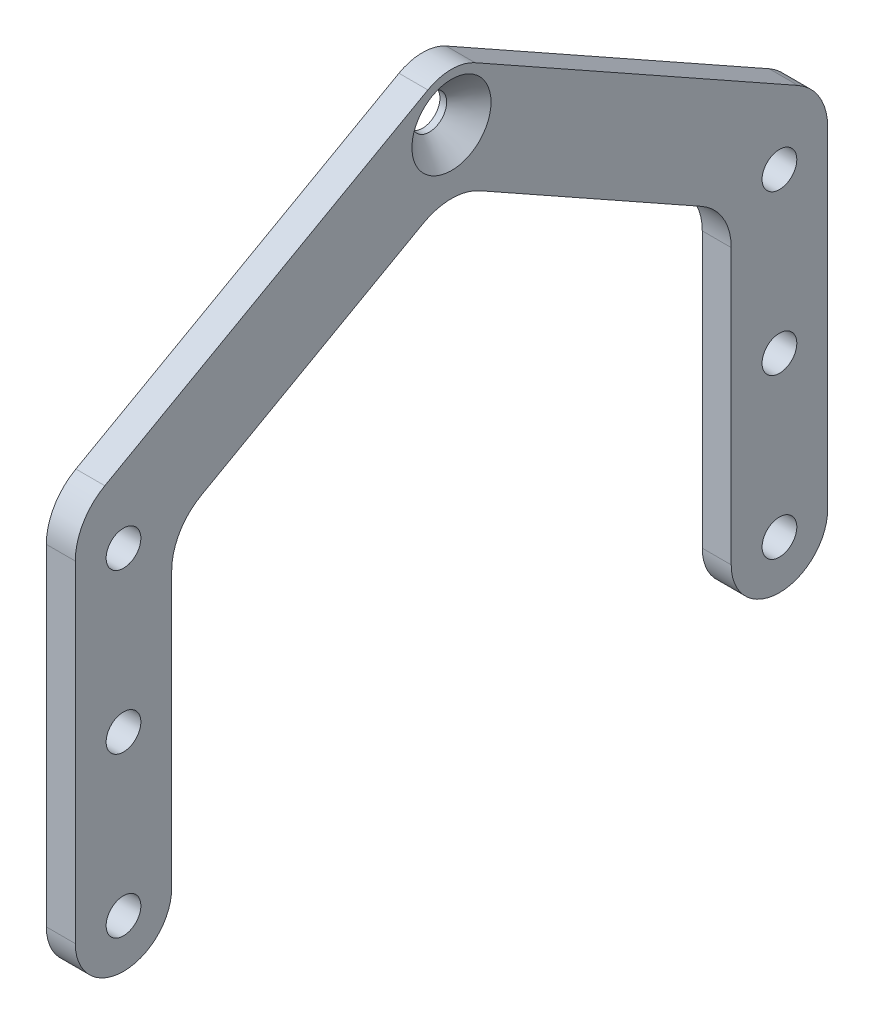
ISO-10303-21;
HEADER;
FILE_DESCRIPTION(('STEP AP214'),'2;1');
FILE_NAME('part.step','',(''),(''),'','','');
FILE_SCHEMA(('AUTOMOTIVE_DESIGN { 1 0 10303 214 1 1 1 1 }'));
ENDSEC;
DATA;
#1=APPLICATION_CONTEXT('core data for automotive mechanical design processes');
#2=APPLICATION_PROTOCOL_DEFINITION('international standard','automotive_design',2000,#1);
#3=PRODUCT_CONTEXT('',#1,'mechanical');
#4=PRODUCT('Part','Part','',(#3));
#5=PRODUCT_RELATED_PRODUCT_CATEGORY('part','',(#4));
#6=PRODUCT_DEFINITION_FORMATION('','',#4);
#7=PRODUCT_DEFINITION_CONTEXT('part definition',#1,'design');
#8=PRODUCT_DEFINITION('design','',#6,#7);
#9=PRODUCT_DEFINITION_SHAPE('','',#8);
#10=(LENGTH_UNIT() NAMED_UNIT(*) SI_UNIT(.MILLI.,.METRE.));
#11=(NAMED_UNIT(*) PLANE_ANGLE_UNIT() SI_UNIT($,.RADIAN.));
#12=(NAMED_UNIT(*) SI_UNIT($,.STERADIAN.) SOLID_ANGLE_UNIT());
#13=UNCERTAINTY_MEASURE_WITH_UNIT(LENGTH_MEASURE(1.E-05),#10,'distance_accuracy_value','');
#14=(GEOMETRIC_REPRESENTATION_CONTEXT(3) GLOBAL_UNCERTAINTY_ASSIGNED_CONTEXT((#13)) GLOBAL_UNIT_ASSIGNED_CONTEXT((#10,
#11,#12)) REPRESENTATION_CONTEXT('',''));
#15=CARTESIAN_POINT('',(0.,0.,0.));
#16=DIRECTION('',(0.,0.,1.));
#17=DIRECTION('',(1.,0.,0.));
#18=AXIS2_PLACEMENT_3D('',#15,#16,#17);
#19=CARTESIAN_POINT('',(1.5,0.,17.));
#20=DIRECTION('',(1.,0.,0.));
#21=DIRECTION('',(0.,0.,-1.));
#22=AXIS2_PLACEMENT_3D('',#19,#20,#21);
#23=PLANE('',#22);
#24=CARTESIAN_POINT('',(1.5,27.,0.));
#25=DIRECTION('',(1.,0.,0.));
#26=DIRECTION('',(0.,0.,-1.));
#27=AXIS2_PLACEMENT_3D('',#24,#25,#26);
#28=CIRCLE('',#27,2.05);
#29=CARTESIAN_POINT('',(1.5,27.,-2.05));
#30=VERTEX_POINT('',#29);
#31=EDGE_CURVE('E246',#30,#30,#28,.T.);
#32=ORIENTED_EDGE('',*,*,#31,.F.);
#33=EDGE_LOOP('',(#32));
#34=FACE_BOUND('',#33,.T.);
#35=CARTESIAN_POINT('',(1.5,8.25000000000001,-17.));
#36=DIRECTION('',(1.,0.,0.));
#37=DIRECTION('',(0.,0.,1.));
#38=AXIS2_PLACEMENT_3D('',#35,#36,#37);
#39=CIRCLE('',#38,0.9);
#40=CARTESIAN_POINT('',(1.5,8.25000000000001,-16.1));
#41=VERTEX_POINT('',#40);
#42=EDGE_CURVE('E236',#41,#41,#39,.T.);
#43=ORIENTED_EDGE('',*,*,#42,.F.);
#44=EDGE_LOOP('',(#43));
#45=FACE_BOUND('',#44,.T.);
#46=CARTESIAN_POINT('',(1.5,8.25,17.));
#47=DIRECTION('',(1.,0.,0.));
#48=DIRECTION('',(0.,0.,-1.));
#49=AXIS2_PLACEMENT_3D('',#46,#47,#48);
#50=CIRCLE('',#49,0.9);
#51=CARTESIAN_POINT('',(1.5,8.25,16.1));
#52=VERTEX_POINT('',#51);
#53=EDGE_CURVE('E233',#52,#52,#50,.T.);
#54=ORIENTED_EDGE('',*,*,#53,.F.);
#55=EDGE_LOOP('',(#54));
#56=FACE_BOUND('',#55,.T.);
#57=CARTESIAN_POINT('',(1.5,16.5,-17.));
#58=DIRECTION('',(1.,0.,0.));
#59=DIRECTION('',(0.,0.,1.));
#60=AXIS2_PLACEMENT_3D('',#57,#58,#59);
#61=CIRCLE('',#60,0.900000000000001);
#62=CARTESIAN_POINT('',(1.5,16.5,-16.1));
#63=VERTEX_POINT('',#62);
#64=EDGE_CURVE('E230',#63,#63,#61,.T.);
#65=ORIENTED_EDGE('',*,*,#64,.F.);
#66=EDGE_LOOP('',(#65));
#67=FACE_BOUND('',#66,.T.);
#68=CARTESIAN_POINT('',(1.5,16.5,17.));
#69=DIRECTION('',(1.,0.,0.));
#70=DIRECTION('',(0.,0.,-1.));
#71=AXIS2_PLACEMENT_3D('',#68,#69,#70);
#72=CIRCLE('',#71,0.900000000000001);
#73=CARTESIAN_POINT('',(1.5,16.5,16.1));
#74=VERTEX_POINT('',#73);
#75=EDGE_CURVE('E226',#74,#74,#72,.T.);
#76=ORIENTED_EDGE('',*,*,#75,.F.);
#77=EDGE_LOOP('',(#76));
#78=FACE_BOUND('',#77,.T.);
#79=CARTESIAN_POINT('',(1.5,0.,-17.));
#80=DIRECTION('',(1.,0.,0.));
#81=DIRECTION('',(0.,0.,1.));
#82=AXIS2_PLACEMENT_3D('',#79,#80,#81);
#83=CIRCLE('',#82,0.9);
#84=CARTESIAN_POINT('',(1.5,0.,-16.1));
#85=VERTEX_POINT('',#84);
#86=EDGE_CURVE('E256',#85,#85,#83,.T.);
#87=ORIENTED_EDGE('',*,*,#86,.F.);
#88=EDGE_LOOP('',(#87));
#89=FACE_BOUND('',#88,.T.);
#90=DIRECTION('',(0.,1.,0.));
#91=VECTOR('',#90,1.);
#92=CARTESIAN_POINT('',(1.5,0.,-19.5));
#93=LINE('',#92,#91);
#94=CARTESIAN_POINT('',(1.5,0.,-19.5));
#95=VERTEX_POINT('',#94);
#96=CARTESIAN_POINT('',(1.5,17.1712927295533,-19.5));
#97=VERTEX_POINT('',#96);
#98=EDGE_CURVE('E276',#95,#97,#93,.T.);
#99=ORIENTED_EDGE('',*,*,#98,.T.);
#100=CARTESIAN_POINT('',(1.5,17.1712927295533,-16.5));
#101=DIRECTION('',(1.,0.,0.));
#102=DIRECTION('',(0.,0.,-1.));
#103=AXIS2_PLACEMENT_3D('',#100,#101,#102);
#104=CIRCLE('',#103,3.);
#105=CARTESIAN_POINT('',(1.5,19.7877679066504,-17.9676708240047));
#106=VERTEX_POINT('',#105);
#107=EDGE_CURVE('E193',#97,#106,#104,.T.);
#108=ORIENTED_EDGE('',*,*,#107,.T.);
#109=DIRECTION('',(0.,0.489223608001568,0.872158392365703));
#110=VECTOR('',#109,1.);
#111=CARTESIAN_POINT('',(1.5,29.1803959809143,-1.22305902000392));
#112=LINE('',#111,#110);
#113=CARTESIAN_POINT('',(1.5,29.1803959809143,-1.22305902000392));
#114=VERTEX_POINT('',#113);
#115=EDGE_CURVE('E278',#106,#114,#112,.T.);
#116=ORIENTED_EDGE('',*,*,#115,.T.);
#117=CARTESIAN_POINT('',(1.5,27.,0.));
#118=DIRECTION('',(1.,0.,0.));
#119=DIRECTION('',(0.,0.,-1.));
#120=AXIS2_PLACEMENT_3D('',#117,#118,#119);
#121=CIRCLE('',#120,2.5);
#122=CARTESIAN_POINT('',(1.5,29.1803959809143,1.22305902000392));
#123=VERTEX_POINT('',#122);
#124=EDGE_CURVE('E280',#114,#123,#121,.T.);
#125=ORIENTED_EDGE('',*,*,#124,.T.);
#126=DIRECTION('',(0.,-0.489223608001568,0.872158392365703));
#127=VECTOR('',#126,1.);
#128=CARTESIAN_POINT('',(1.5,18.9282318238833,19.5));
#129=LINE('',#128,#127);
#130=CARTESIAN_POINT('',(1.5,19.7877679066504,17.9676708240047));
#131=VERTEX_POINT('',#130);
#132=EDGE_CURVE('E282',#123,#131,#129,.T.);
#133=ORIENTED_EDGE('',*,*,#132,.T.);
#134=CARTESIAN_POINT('',(1.5,17.1712927295533,16.5));
#135=DIRECTION('',(1.,0.,0.));
#136=DIRECTION('',(0.,0.,-1.));
#137=AXIS2_PLACEMENT_3D('',#134,#135,#136);
#138=CIRCLE('',#137,3.);
#139=CARTESIAN_POINT('',(1.5,17.1712927295533,19.5));
#140=VERTEX_POINT('',#139);
#141=EDGE_CURVE('E52',#131,#140,#138,.T.);
#142=ORIENTED_EDGE('',*,*,#141,.T.);
#143=DIRECTION('',(0.,-1.,0.));
#144=VECTOR('',#143,1.);
#145=CARTESIAN_POINT('',(1.5,0.,19.5));
#146=LINE('',#145,#144);
#147=CARTESIAN_POINT('',(1.5,0.,19.5));
#148=VERTEX_POINT('',#147);
#149=EDGE_CURVE('E167',#140,#148,#146,.T.);
#150=ORIENTED_EDGE('',*,*,#149,.T.);
#151=CARTESIAN_POINT('',(1.5,0.,17.));
#152=DIRECTION('',(1.,0.,0.));
#153=DIRECTION('',(0.,0.,-1.));
#154=AXIS2_PLACEMENT_3D('',#151,#152,#153);
#155=CIRCLE('',#154,2.5);
#156=CARTESIAN_POINT('',(1.5,0.,14.5));
#157=VERTEX_POINT('',#156);
#158=EDGE_CURVE('E162',#148,#157,#155,.T.);
#159=ORIENTED_EDGE('',*,*,#158,.T.);
#160=DIRECTION('',(0.,1.,0.));
#161=VECTOR('',#160,1.);
#162=CARTESIAN_POINT('',(1.5,0.,14.5));
#163=LINE('',#162,#161);
#164=CARTESIAN_POINT('',(1.5,14.24306090567,14.5));
#165=VERTEX_POINT('',#164);
#166=EDGE_CURVE('E151',#157,#165,#163,.T.);
#167=ORIENTED_EDGE('',*,*,#166,.T.);
#168=CARTESIAN_POINT('',(1.5,14.24306090567,11.5));
#169=DIRECTION('',(1.,0.,0.));
#170=DIRECTION('',(0.,0.,-1.));
#171=AXIS2_PLACEMENT_3D('',#168,#169,#170);
#172=CIRCLE('',#171,3.);
#173=CARTESIAN_POINT('',(1.5,16.8595360827671,12.9676708240047));
#174=VERTEX_POINT('',#173);
#175=EDGE_CURVE('E11',#165,#174,#172,.F.);
#176=ORIENTED_EDGE('',*,*,#175,.T.);
#177=DIRECTION('',(0.,0.489223608001568,-0.872158392365703));
#178=VECTOR('',#177,1.);
#179=CARTESIAN_POINT('',(1.5,16.,14.5));
#180=LINE('',#179,#178);
#181=CARTESIAN_POINT('',(1.5,23.3102812011595,1.46767082400471));
#182=VERTEX_POINT('',#181);
#183=EDGE_CURVE('E161',#174,#182,#180,.T.);
#184=ORIENTED_EDGE('',*,*,#183,.T.);
#185=CARTESIAN_POINT('',(1.5,20.6938060240624,0.));
#186=DIRECTION('',(1.,0.,0.));
#187=DIRECTION('',(0.,0.,-1.));
#188=AXIS2_PLACEMENT_3D('',#185,#186,#187);
#189=CIRCLE('',#188,3.);
#190=CARTESIAN_POINT('',(1.5,23.3102812011595,-1.4676708240047));
#191=VERTEX_POINT('',#190);
#192=EDGE_CURVE('E219',#182,#191,#189,.F.);
#193=ORIENTED_EDGE('',*,*,#192,.T.);
#194=DIRECTION('',(0.,-0.489223608001568,-0.872158392365703));
#195=VECTOR('',#194,1.);
#196=CARTESIAN_POINT('',(1.5,24.1335481927556,0.));
#197=LINE('',#196,#195);
#198=CARTESIAN_POINT('',(1.5,16.8595360827671,-12.9676708240047));
#199=VERTEX_POINT('',#198);
#200=EDGE_CURVE('E269',#191,#199,#197,.T.);
#201=ORIENTED_EDGE('',*,*,#200,.T.);
#202=CARTESIAN_POINT('',(1.5,14.24306090567,-11.5));
#203=DIRECTION('',(1.,0.,0.));
#204=DIRECTION('',(0.,0.,-1.));
#205=AXIS2_PLACEMENT_3D('',#202,#203,#204);
#206=CIRCLE('',#205,3.);
#207=CARTESIAN_POINT('',(1.5,14.24306090567,-14.5));
#208=VERTEX_POINT('',#207);
#209=EDGE_CURVE('E215',#199,#208,#206,.F.);
#210=ORIENTED_EDGE('',*,*,#209,.T.);
#211=DIRECTION('',(0.,-1.,0.));
#212=VECTOR('',#211,1.);
#213=CARTESIAN_POINT('',(1.5,0.,-14.5));
#214=LINE('',#213,#212);
#215=CARTESIAN_POINT('',(1.5,0.,-14.5));
#216=VERTEX_POINT('',#215);
#217=EDGE_CURVE('E272',#208,#216,#214,.T.);
#218=ORIENTED_EDGE('',*,*,#217,.T.);
#219=CARTESIAN_POINT('',(1.5,0.,-17.));
#220=DIRECTION('',(1.,0.,0.));
#221=DIRECTION('',(0.,0.,-1.));
#222=AXIS2_PLACEMENT_3D('',#219,#220,#221);
#223=CIRCLE('',#222,2.5);
#224=EDGE_CURVE('E274',#216,#95,#223,.T.);
#225=ORIENTED_EDGE('',*,*,#224,.T.);
#226=EDGE_LOOP('',(#99,#108,#116,#125,#133,#142,#150,#159,#167,#176,#184,#193,#201,#210,#218,#225));
#227=FACE_BOUND('',#226,.T.);
#228=CARTESIAN_POINT('',(1.5,0.,17.));
#229=DIRECTION('',(1.,0.,0.));
#230=DIRECTION('',(0.,0.,-1.));
#231=AXIS2_PLACEMENT_3D('',#228,#229,#230);
#232=CIRCLE('',#231,0.9);
#233=CARTESIAN_POINT('',(1.5,0.,16.1));
#234=VERTEX_POINT('',#233);
#235=EDGE_CURVE('E262',#234,#234,#232,.T.);
#236=ORIENTED_EDGE('',*,*,#235,.F.);
#237=EDGE_LOOP('',(#236));
#238=FACE_BOUND('',#237,.T.);
#239=ADVANCED_FACE('F35',(#34,#45,#56,#67,#78,#89,#227,#238),#23,.T.);
#240=CARTESIAN_POINT('',(0.,0.,17.));
#241=DIRECTION('',(1.,0.,0.));
#242=DIRECTION('',(0.,0.,-1.));
#243=AXIS2_PLACEMENT_3D('',#240,#241,#242);
#244=PLANE('',#243);
#245=CARTESIAN_POINT('',(0.,8.25000000000001,-17.));
#246=DIRECTION('',(1.,0.,0.));
#247=DIRECTION('',(0.,0.,-1.));
#248=AXIS2_PLACEMENT_3D('',#245,#246,#247);
#249=CIRCLE('',#248,0.9);
#250=CARTESIAN_POINT('',(0.,8.25000000000001,-17.9));
#251=VERTEX_POINT('',#250);
#252=EDGE_CURVE('E234',#251,#251,#249,.T.);
#253=ORIENTED_EDGE('',*,*,#252,.T.);
#254=EDGE_LOOP('',(#253));
#255=FACE_BOUND('',#254,.T.);
#256=CARTESIAN_POINT('',(0.,8.25,17.));
#257=DIRECTION('',(1.,0.,0.));
#258=DIRECTION('',(0.,0.,-1.));
#259=AXIS2_PLACEMENT_3D('',#256,#257,#258);
#260=CIRCLE('',#259,0.9);
#261=CARTESIAN_POINT('',(0.,8.25,16.1));
#262=VERTEX_POINT('',#261);
#263=EDGE_CURVE('E231',#262,#262,#260,.T.);
#264=ORIENTED_EDGE('',*,*,#263,.T.);
#265=EDGE_LOOP('',(#264));
#266=FACE_BOUND('',#265,.T.);
#267=CARTESIAN_POINT('',(0.,16.5,-17.));
#268=DIRECTION('',(1.,0.,0.));
#269=DIRECTION('',(0.,0.,-1.));
#270=AXIS2_PLACEMENT_3D('',#267,#268,#269);
#271=CIRCLE('',#270,0.900000000000001);
#272=CARTESIAN_POINT('',(0.,16.5,-17.9));
#273=VERTEX_POINT('',#272);
#274=EDGE_CURVE('E227',#273,#273,#271,.T.);
#275=ORIENTED_EDGE('',*,*,#274,.T.);
#276=EDGE_LOOP('',(#275));
#277=FACE_BOUND('',#276,.T.);
#278=CARTESIAN_POINT('',(0.,16.5,17.));
#279=DIRECTION('',(1.,0.,0.));
#280=DIRECTION('',(0.,0.,-1.));
#281=AXIS2_PLACEMENT_3D('',#278,#279,#280);
#282=CIRCLE('',#281,0.900000000000001);
#283=CARTESIAN_POINT('',(0.,16.5,16.1));
#284=VERTEX_POINT('',#283);
#285=EDGE_CURVE('E222',#284,#284,#282,.T.);
#286=ORIENTED_EDGE('',*,*,#285,.T.);
#287=EDGE_LOOP('',(#286));
#288=FACE_BOUND('',#287,.T.);
#289=CARTESIAN_POINT('',(0.,0.,-17.));
#290=DIRECTION('',(1.,0.,0.));
#291=DIRECTION('',(0.,0.,1.));
#292=AXIS2_PLACEMENT_3D('',#289,#290,#291);
#293=CIRCLE('',#292,0.9);
#294=CARTESIAN_POINT('',(0.,0.,-16.1));
#295=VERTEX_POINT('',#294);
#296=EDGE_CURVE('E255',#295,#295,#293,.T.);
#297=ORIENTED_EDGE('',*,*,#296,.T.);
#298=EDGE_LOOP('',(#297));
#299=FACE_BOUND('',#298,.T.);
#300=DIRECTION('',(0.,0.489223608001568,0.872158392365703));
#301=VECTOR('',#300,1.);
#302=CARTESIAN_POINT('',(0.,29.1803959809143,-1.22305902000392));
#303=LINE('',#302,#301);
#304=CARTESIAN_POINT('',(0.,19.7877679066504,-17.9676708240047));
#305=VERTEX_POINT('',#304);
#306=CARTESIAN_POINT('',(0.,29.1803959809143,-1.22305902000392));
#307=VERTEX_POINT('',#306);
#308=EDGE_CURVE('E302',#305,#307,#303,.T.);
#309=ORIENTED_EDGE('',*,*,#308,.F.);
#310=CARTESIAN_POINT('',(0.,17.1712927295533,-16.5));
#311=DIRECTION('',(1.,0.,0.));
#312=DIRECTION('',(0.,0.,-1.));
#313=AXIS2_PLACEMENT_3D('',#310,#311,#312);
#314=CIRCLE('',#313,3.);
#315=CARTESIAN_POINT('',(0.,17.1712927295533,-19.5));
#316=VERTEX_POINT('',#315);
#317=EDGE_CURVE('E188',#305,#316,#314,.F.);
#318=ORIENTED_EDGE('',*,*,#317,.T.);
#319=DIRECTION('',(0.,1.,0.));
#320=VECTOR('',#319,1.);
#321=CARTESIAN_POINT('',(0.,0.,-19.5));
#322=LINE('',#321,#320);
#323=CARTESIAN_POINT('',(0.,0.,-19.5));
#324=VERTEX_POINT('',#323);
#325=EDGE_CURVE('E299',#324,#316,#322,.T.);
#326=ORIENTED_EDGE('',*,*,#325,.F.);
#327=CARTESIAN_POINT('',(0.,0.,-17.));
#328=DIRECTION('',(1.,0.,0.));
#329=DIRECTION('',(0.,0.,-1.));
#330=AXIS2_PLACEMENT_3D('',#327,#328,#329);
#331=CIRCLE('',#330,2.5);
#332=CARTESIAN_POINT('',(0.,0.,-14.5));
#333=VERTEX_POINT('',#332);
#334=EDGE_CURVE('E297',#333,#324,#331,.T.);
#335=ORIENTED_EDGE('',*,*,#334,.F.);
#336=DIRECTION('',(0.,-1.,0.));
#337=VECTOR('',#336,1.);
#338=CARTESIAN_POINT('',(0.,0.,-14.5));
#339=LINE('',#338,#337);
#340=CARTESIAN_POINT('',(0.,14.24306090567,-14.5));
#341=VERTEX_POINT('',#340);
#342=EDGE_CURVE('E295',#341,#333,#339,.T.);
#343=ORIENTED_EDGE('',*,*,#342,.F.);
#344=CARTESIAN_POINT('',(0.,14.24306090567,-11.5));
#345=DIRECTION('',(1.,0.,0.));
#346=DIRECTION('',(0.,0.,-1.));
#347=AXIS2_PLACEMENT_3D('',#344,#345,#346);
#348=CIRCLE('',#347,3.);
#349=CARTESIAN_POINT('',(0.,16.8595360827671,-12.9676708240047));
#350=VERTEX_POINT('',#349);
#351=EDGE_CURVE('E213',#341,#350,#348,.T.);
#352=ORIENTED_EDGE('',*,*,#351,.T.);
#353=DIRECTION('',(0.,-0.489223608001568,-0.872158392365703));
#354=VECTOR('',#353,1.);
#355=CARTESIAN_POINT('',(0.,24.1335481927556,0.));
#356=LINE('',#355,#354);
#357=CARTESIAN_POINT('',(0.,23.3102812011595,-1.4676708240047));
#358=VERTEX_POINT('',#357);
#359=EDGE_CURVE('E292',#358,#350,#356,.T.);
#360=ORIENTED_EDGE('',*,*,#359,.F.);
#361=CARTESIAN_POINT('',(0.,20.6938060240624,0.));
#362=DIRECTION('',(1.,0.,0.));
#363=DIRECTION('',(0.,0.,-1.));
#364=AXIS2_PLACEMENT_3D('',#361,#362,#363);
#365=CIRCLE('',#364,3.);
#366=CARTESIAN_POINT('',(0.,23.3102812011595,1.46767082400471));
#367=VERTEX_POINT('',#366);
#368=EDGE_CURVE('E217',#358,#367,#365,.T.);
#369=ORIENTED_EDGE('',*,*,#368,.T.);
#370=DIRECTION('',(0.,0.489223608001568,-0.872158392365703));
#371=VECTOR('',#370,1.);
#372=CARTESIAN_POINT('',(0.,16.,14.5));
#373=LINE('',#372,#371);
#374=CARTESIAN_POINT('',(0.,16.8595360827671,12.9676708240047));
#375=VERTEX_POINT('',#374);
#376=EDGE_CURVE('E289',#375,#367,#373,.T.);
#377=ORIENTED_EDGE('',*,*,#376,.F.);
#378=CARTESIAN_POINT('',(0.,14.24306090567,11.5));
#379=DIRECTION('',(1.,0.,0.));
#380=DIRECTION('',(0.,0.,-1.));
#381=AXIS2_PLACEMENT_3D('',#378,#379,#380);
#382=CIRCLE('',#381,3.);
#383=CARTESIAN_POINT('',(0.,14.24306090567,14.5));
#384=VERTEX_POINT('',#383);
#385=EDGE_CURVE('E44',#375,#384,#382,.T.);
#386=ORIENTED_EDGE('',*,*,#385,.T.);
#387=DIRECTION('',(0.,1.,0.));
#388=VECTOR('',#387,1.);
#389=CARTESIAN_POINT('',(0.,0.,14.5));
#390=LINE('',#389,#388);
#391=CARTESIAN_POINT('',(0.,0.,14.5));
#392=VERTEX_POINT('',#391);
#393=EDGE_CURVE('E287',#392,#384,#390,.T.);
#394=ORIENTED_EDGE('',*,*,#393,.F.);
#395=CARTESIAN_POINT('',(0.,0.,17.));
#396=DIRECTION('',(1.,0.,0.));
#397=DIRECTION('',(0.,0.,-1.));
#398=AXIS2_PLACEMENT_3D('',#395,#396,#397);
#399=CIRCLE('',#398,2.5);
#400=CARTESIAN_POINT('',(0.,0.,19.5));
#401=VERTEX_POINT('',#400);
#402=EDGE_CURVE('E175',#401,#392,#399,.T.);
#403=ORIENTED_EDGE('',*,*,#402,.F.);
#404=DIRECTION('',(0.,-1.,0.));
#405=VECTOR('',#404,1.);
#406=CARTESIAN_POINT('',(0.,0.,19.5));
#407=LINE('',#406,#405);
#408=CARTESIAN_POINT('',(0.,17.1712927295533,19.5));
#409=VERTEX_POINT('',#408);
#410=EDGE_CURVE('E171',#409,#401,#407,.T.);
#411=ORIENTED_EDGE('',*,*,#410,.F.);
#412=CARTESIAN_POINT('',(0.,17.1712927295533,16.5));
#413=DIRECTION('',(1.,0.,0.));
#414=DIRECTION('',(0.,0.,-1.));
#415=AXIS2_PLACEMENT_3D('',#412,#413,#414);
#416=CIRCLE('',#415,3.);
#417=CARTESIAN_POINT('',(0.,19.7877679066504,17.9676708240047));
#418=VERTEX_POINT('',#417);
#419=EDGE_CURVE('E180',#409,#418,#416,.F.);
#420=ORIENTED_EDGE('',*,*,#419,.T.);
#421=DIRECTION('',(0.,-0.489223608001568,0.872158392365703));
#422=VECTOR('',#421,1.);
#423=CARTESIAN_POINT('',(0.,18.9282318238833,19.5));
#424=LINE('',#423,#422);
#425=CARTESIAN_POINT('',(0.,29.1803959809143,1.22305902000392));
#426=VERTEX_POINT('',#425);
#427=EDGE_CURVE('E306',#426,#418,#424,.T.);
#428=ORIENTED_EDGE('',*,*,#427,.F.);
#429=CARTESIAN_POINT('',(0.,27.,0.));
#430=DIRECTION('',(1.,0.,0.));
#431=DIRECTION('',(0.,0.,-1.));
#432=AXIS2_PLACEMENT_3D('',#429,#430,#431);
#433=CIRCLE('',#432,2.5);
#434=EDGE_CURVE('E304',#307,#426,#433,.T.);
#435=ORIENTED_EDGE('',*,*,#434,.F.);
#436=EDGE_LOOP('',(#309,#318,#326,#335,#343,#352,#360,#369,#377,#386,#394,#403,#411,#420,#428,#435));
#437=FACE_BOUND('',#436,.T.);
#438=CARTESIAN_POINT('',(0.,0.,17.));
#439=DIRECTION('',(1.,0.,0.));
#440=DIRECTION('',(0.,0.,-1.));
#441=AXIS2_PLACEMENT_3D('',#438,#439,#440);
#442=CIRCLE('',#441,0.9);
#443=CARTESIAN_POINT('',(0.,0.,16.1));
#444=VERTEX_POINT('',#443);
#445=EDGE_CURVE('E259',#444,#444,#442,.T.);
#446=ORIENTED_EDGE('',*,*,#445,.T.);
#447=EDGE_LOOP('',(#446));
#448=FACE_BOUND('',#447,.T.);
#449=CARTESIAN_POINT('',(0.,27.,0.));
#450=DIRECTION('',(1.,0.,0.));
#451=DIRECTION('',(0.,0.,-1.));
#452=AXIS2_PLACEMENT_3D('',#449,#450,#451);
#453=CIRCLE('',#452,0.9);
#454=CARTESIAN_POINT('',(0.,27.,-0.9));
#455=VERTEX_POINT('',#454);
#456=EDGE_CURVE('E225',#455,#455,#453,.T.);
#457=ORIENTED_EDGE('',*,*,#456,.T.);
#458=EDGE_LOOP('',(#457));
#459=FACE_BOUND('',#458,.T.);
#460=ADVANCED_FACE('F327',(#255,#266,#277,#288,#299,#437,#448,#459),#244,.F.);
#461=CARTESIAN_POINT('',(1.5,0.,17.));
#462=DIRECTION('',(-1.,0.,0.));
#463=DIRECTION('',(0.,0.,1.));
#464=AXIS2_PLACEMENT_3D('',#461,#462,#463);
#465=CYLINDRICAL_SURFACE('',#464,2.5);
#466=ORIENTED_EDGE('',*,*,#402,.T.);
#467=DIRECTION('',(-1.,0.,0.));
#468=VECTOR('',#467,1.);
#469=CARTESIAN_POINT('',(1.5,0.,14.5));
#470=LINE('',#469,#468);
#471=EDGE_CURVE('E156',#157,#392,#470,.T.);
#472=ORIENTED_EDGE('',*,*,#471,.F.);
#473=ORIENTED_EDGE('',*,*,#158,.F.);
#474=DIRECTION('',(-1.,0.,0.));
#475=VECTOR('',#474,1.);
#476=CARTESIAN_POINT('',(1.5,0.,19.5));
#477=LINE('',#476,#475);
#478=EDGE_CURVE('E285',#148,#401,#477,.T.);
#479=ORIENTED_EDGE('',*,*,#478,.T.);
#480=EDGE_LOOP('',(#466,#472,#473,#479));
#481=FACE_BOUND('',#480,.T.);
#482=ADVANCED_FACE('F173',(#481),#465,.T.);
#483=CARTESIAN_POINT('',(1.5,0.,14.5));
#484=DIRECTION('',(0.,0.,1.));
#485=DIRECTION('',(0.,-1.,0.));
#486=AXIS2_PLACEMENT_3D('',#483,#484,#485);
#487=PLANE('',#486);
#488=ORIENTED_EDGE('',*,*,#393,.T.);
#489=DIRECTION('',(-1.,0.,0.));
#490=VECTOR('',#489,1.);
#491=CARTESIAN_POINT('',(1.5,14.24306090567,14.5));
#492=LINE('',#491,#490);
#493=EDGE_CURVE('E159',#384,#165,#492,.F.);
#494=ORIENTED_EDGE('',*,*,#493,.T.);
#495=ORIENTED_EDGE('',*,*,#166,.F.);
#496=ORIENTED_EDGE('',*,*,#471,.T.);
#497=EDGE_LOOP('',(#488,#494,#495,#496));
#498=FACE_BOUND('',#497,.T.);
#499=ADVANCED_FACE('F154',(#498),#487,.F.);
#500=CARTESIAN_POINT('',(1.5,16.,14.5));
#501=DIRECTION('',(0.,0.872158392365703,0.489223608001568));
#502=DIRECTION('',(0.,-0.489223608001568,0.872158392365703));
#503=AXIS2_PLACEMENT_3D('',#500,#501,#502);
#504=PLANE('',#503);
#505=ORIENTED_EDGE('',*,*,#376,.T.);
#506=DIRECTION('',(-1.,0.,0.));
#507=VECTOR('',#506,1.);
#508=CARTESIAN_POINT('',(1.5,23.3102812011595,1.4676708240047));
#509=LINE('',#508,#507);
#510=EDGE_CURVE('E206',#367,#182,#509,.F.);
#511=ORIENTED_EDGE('',*,*,#510,.T.);
#512=ORIENTED_EDGE('',*,*,#183,.F.);
#513=DIRECTION('',(-1.,0.,0.));
#514=VECTOR('',#513,1.);
#515=CARTESIAN_POINT('',(0.,16.8595360827671,12.9676708240047));
#516=LINE('',#515,#514);
#517=EDGE_CURVE('E203',#174,#375,#516,.T.);
#518=ORIENTED_EDGE('',*,*,#517,.T.);
#519=EDGE_LOOP('',(#505,#511,#512,#518));
#520=FACE_BOUND('',#519,.T.);
#521=ADVANCED_FACE('F362',(#520),#504,.F.);
#522=CARTESIAN_POINT('',(1.5,24.1335481927556,0.));
#523=DIRECTION('',(0.,0.872158392365703,-0.489223608001568));
#524=DIRECTION('',(0.,0.489223608001568,0.872158392365703));
#525=AXIS2_PLACEMENT_3D('',#522,#523,#524);
#526=PLANE('',#525);
#527=ORIENTED_EDGE('',*,*,#359,.T.);
#528=DIRECTION('',(-1.,0.,0.));
#529=VECTOR('',#528,1.);
#530=CARTESIAN_POINT('',(1.5,16.8595360827671,-12.9676708240047));
#531=LINE('',#530,#529);
#532=EDGE_CURVE('E201',#350,#199,#531,.F.);
#533=ORIENTED_EDGE('',*,*,#532,.T.);
#534=ORIENTED_EDGE('',*,*,#200,.F.);
#535=DIRECTION('',(-1.,0.,0.));
#536=VECTOR('',#535,1.);
#537=CARTESIAN_POINT('',(0.,23.3102812011595,-1.4676708240047));
#538=LINE('',#537,#536);
#539=EDGE_CURVE('E198',#191,#358,#538,.T.);
#540=ORIENTED_EDGE('',*,*,#539,.T.);
#541=EDGE_LOOP('',(#527,#533,#534,#540));
#542=FACE_BOUND('',#541,.T.);
#543=ADVANCED_FACE('F351',(#542),#526,.F.);
#544=CARTESIAN_POINT('',(1.5,0.,-14.5));
#545=DIRECTION('',(0.,0.,-1.));
#546=DIRECTION('',(0.,1.,0.));
#547=AXIS2_PLACEMENT_3D('',#544,#545,#546);
#548=PLANE('',#547);
#549=ORIENTED_EDGE('',*,*,#217,.F.);
#550=DIRECTION('',(-1.,0.,0.));
#551=VECTOR('',#550,1.);
#552=CARTESIAN_POINT('',(0.,14.24306090567,-14.5));
#553=LINE('',#552,#551);
#554=EDGE_CURVE('E195',#208,#341,#553,.T.);
#555=ORIENTED_EDGE('',*,*,#554,.T.);
#556=ORIENTED_EDGE('',*,*,#342,.T.);
#557=DIRECTION('',(-1.,0.,0.));
#558=VECTOR('',#557,1.);
#559=CARTESIAN_POINT('',(1.5,0.,-14.5));
#560=LINE('',#559,#558);
#561=EDGE_CURVE('E177',#216,#333,#560,.T.);
#562=ORIENTED_EDGE('',*,*,#561,.F.);
#563=EDGE_LOOP('',(#549,#555,#556,#562));
#564=FACE_BOUND('',#563,.T.);
#565=ADVANCED_FACE('F345',(#564),#548,.F.);
#566=CARTESIAN_POINT('',(1.5,0.,-17.));
#567=DIRECTION('',(-1.,0.,0.));
#568=DIRECTION('',(0.,0.,1.));
#569=AXIS2_PLACEMENT_3D('',#566,#567,#568);
#570=CYLINDRICAL_SURFACE('',#569,2.5);
#571=ORIENTED_EDGE('',*,*,#334,.T.);
#572=DIRECTION('',(-1.,0.,0.));
#573=VECTOR('',#572,1.);
#574=CARTESIAN_POINT('',(1.5,0.,-19.5));
#575=LINE('',#574,#573);
#576=EDGE_CURVE('E183',#95,#324,#575,.T.);
#577=ORIENTED_EDGE('',*,*,#576,.F.);
#578=ORIENTED_EDGE('',*,*,#224,.F.);
#579=ORIENTED_EDGE('',*,*,#561,.T.);
#580=EDGE_LOOP('',(#571,#577,#578,#579));
#581=FACE_BOUND('',#580,.T.);
#582=ADVANCED_FACE('F343',(#581),#570,.T.);
#583=CARTESIAN_POINT('',(1.5,0.,-19.5));
#584=DIRECTION('',(0.,0.,1.));
#585=DIRECTION('',(1.,0.,0.));
#586=AXIS2_PLACEMENT_3D('',#583,#584,#585);
#587=PLANE('',#586);
#588=ORIENTED_EDGE('',*,*,#325,.T.);
#589=DIRECTION('',(-1.,0.,0.));
#590=VECTOR('',#589,1.);
#591=CARTESIAN_POINT('',(1.5,17.1712927295533,-19.5));
#592=LINE('',#591,#590);
#593=EDGE_CURVE('E190',#316,#97,#592,.F.);
#594=ORIENTED_EDGE('',*,*,#593,.T.);
#595=ORIENTED_EDGE('',*,*,#98,.F.);
#596=ORIENTED_EDGE('',*,*,#576,.T.);
#597=EDGE_LOOP('',(#588,#594,#595,#596));
#598=FACE_BOUND('',#597,.T.);
#599=ADVANCED_FACE('F320',(#598),#587,.F.);
#600=CARTESIAN_POINT('',(1.5,29.1803959809143,-1.22305902000392));
#601=DIRECTION('',(0.,-0.872158392365703,0.489223608001568));
#602=DIRECTION('',(0.,-0.489223608001568,-0.872158392365703));
#603=AXIS2_PLACEMENT_3D('',#600,#601,#602);
#604=PLANE('',#603);
#605=ORIENTED_EDGE('',*,*,#115,.F.);
#606=DIRECTION('',(-1.,0.,0.));
#607=VECTOR('',#606,1.);
#608=CARTESIAN_POINT('',(1.5,19.7877679066504,-17.9676708240047));
#609=LINE('',#608,#607);
#610=EDGE_CURVE('E176',#106,#305,#609,.T.);
#611=ORIENTED_EDGE('',*,*,#610,.T.);
#612=ORIENTED_EDGE('',*,*,#308,.T.);
#613=DIRECTION('',(-1.,0.,0.));
#614=VECTOR('',#613,1.);
#615=CARTESIAN_POINT('',(1.5,29.1803959809143,-1.22305902000392));
#616=LINE('',#615,#614);
#617=EDGE_CURVE('E313',#114,#307,#616,.T.);
#618=ORIENTED_EDGE('',*,*,#617,.F.);
#619=EDGE_LOOP('',(#605,#611,#612,#618));
#620=FACE_BOUND('',#619,.T.);
#621=ADVANCED_FACE('F337',(#620),#604,.F.);
#622=CARTESIAN_POINT('',(1.5,27.,0.));
#623=DIRECTION('',(-1.,0.,0.));
#624=DIRECTION('',(0.,0.,1.));
#625=AXIS2_PLACEMENT_3D('',#622,#623,#624);
#626=CYLINDRICAL_SURFACE('',#625,2.5);
#627=ORIENTED_EDGE('',*,*,#434,.T.);
#628=DIRECTION('',(-1.,0.,0.));
#629=VECTOR('',#628,1.);
#630=CARTESIAN_POINT('',(1.5,29.1803959809143,1.22305902000392));
#631=LINE('',#630,#629);
#632=EDGE_CURVE('E310',#123,#426,#631,.T.);
#633=ORIENTED_EDGE('',*,*,#632,.F.);
#634=ORIENTED_EDGE('',*,*,#124,.F.);
#635=ORIENTED_EDGE('',*,*,#617,.T.);
#636=EDGE_LOOP('',(#627,#633,#634,#635));
#637=FACE_BOUND('',#636,.T.);
#638=ADVANCED_FACE('F400',(#637),#626,.T.);
#639=CARTESIAN_POINT('',(1.5,18.9282318238833,19.5));
#640=DIRECTION('',(0.,-0.872158392365703,-0.489223608001568));
#641=DIRECTION('',(0.,0.489223608001568,-0.872158392365703));
#642=AXIS2_PLACEMENT_3D('',#639,#640,#641);
#643=PLANE('',#642);
#644=ORIENTED_EDGE('',*,*,#427,.T.);
#645=DIRECTION('',(-1.,0.,0.));
#646=VECTOR('',#645,1.);
#647=CARTESIAN_POINT('',(1.5,19.7877679066504,17.9676708240047));
#648=LINE('',#647,#646);
#649=EDGE_CURVE('E60',#418,#131,#648,.F.);
#650=ORIENTED_EDGE('',*,*,#649,.T.);
#651=ORIENTED_EDGE('',*,*,#132,.F.);
#652=ORIENTED_EDGE('',*,*,#632,.T.);
#653=EDGE_LOOP('',(#644,#650,#651,#652));
#654=FACE_BOUND('',#653,.T.);
#655=ADVANCED_FACE('F397',(#654),#643,.F.);
#656=CARTESIAN_POINT('',(1.5,0.,19.5));
#657=DIRECTION('',(0.,0.,-1.));
#658=DIRECTION('',(0.,1.,0.));
#659=AXIS2_PLACEMENT_3D('',#656,#657,#658);
#660=PLANE('',#659);
#661=ORIENTED_EDGE('',*,*,#149,.F.);
#662=DIRECTION('',(-1.,0.,0.));
#663=VECTOR('',#662,1.);
#664=CARTESIAN_POINT('',(1.5,17.1712927295533,19.5));
#665=LINE('',#664,#663);
#666=EDGE_CURVE('E209',#140,#409,#665,.T.);
#667=ORIENTED_EDGE('',*,*,#666,.T.);
#668=ORIENTED_EDGE('',*,*,#410,.T.);
#669=ORIENTED_EDGE('',*,*,#478,.F.);
#670=EDGE_LOOP('',(#661,#667,#668,#669));
#671=FACE_BOUND('',#670,.T.);
#672=ADVANCED_FACE('F370',(#671),#660,.F.);
#673=CARTESIAN_POINT('',(1.5,0.,17.));
#674=DIRECTION('',(-1.,0.,0.));
#675=DIRECTION('',(0.,0.,1.));
#676=AXIS2_PLACEMENT_3D('',#673,#674,#675);
#677=CYLINDRICAL_SURFACE('',#676,0.9);
#678=ORIENTED_EDGE('',*,*,#235,.T.);
#679=EDGE_LOOP('',(#678));
#680=FACE_BOUND('',#679,.T.);
#681=ORIENTED_EDGE('',*,*,#445,.F.);
#682=EDGE_LOOP('',(#681));
#683=FACE_BOUND('',#682,.T.);
#684=ADVANCED_FACE('F392',(#680,#683),#677,.F.);
#685=CARTESIAN_POINT('',(1.5,0.,-17.));
#686=DIRECTION('',(-1.,0.,0.));
#687=DIRECTION('',(0.,0.,1.));
#688=AXIS2_PLACEMENT_3D('',#685,#686,#687);
#689=CYLINDRICAL_SURFACE('',#688,0.9);
#690=ORIENTED_EDGE('',*,*,#86,.T.);
#691=EDGE_LOOP('',(#690));
#692=FACE_BOUND('',#691,.T.);
#693=ORIENTED_EDGE('',*,*,#296,.F.);
#694=EDGE_LOOP('',(#693));
#695=FACE_BOUND('',#694,.T.);
#696=ADVANCED_FACE('F495',(#692,#695),#689,.F.);
#697=CARTESIAN_POINT('',(1.5,27.,0.));
#698=DIRECTION('',(-1.,0.,0.));
#699=DIRECTION('',(0.,0.,1.));
#700=AXIS2_PLACEMENT_3D('',#697,#698,#699);
#701=CYLINDRICAL_SURFACE('',#700,0.9);
#702=CARTESIAN_POINT('',(0.350000000000001,27.,0.));
#703=DIRECTION('',(1.,0.,0.));
#704=DIRECTION('',(0.,0.,-1.));
#705=AXIS2_PLACEMENT_3D('',#702,#703,#704);
#706=CIRCLE('',#705,0.9);
#707=CARTESIAN_POINT('',(0.350000000000001,27.,-0.9));
#708=VERTEX_POINT('',#707);
#709=EDGE_CURVE('E39',#708,#708,#706,.F.);
#710=ORIENTED_EDGE('',*,*,#709,.F.);
#711=EDGE_LOOP('',(#710));
#712=FACE_BOUND('',#711,.T.);
#713=ORIENTED_EDGE('',*,*,#456,.F.);
#714=EDGE_LOOP('',(#713));
#715=FACE_BOUND('',#714,.T.);
#716=ADVANCED_FACE('F422',(#712,#715),#701,.F.);
#717=CARTESIAN_POINT('',(1.5,17.1712927295533,-16.5));
#718=DIRECTION('',(-1.,0.,0.));
#719=DIRECTION('',(0.,0.,1.));
#720=AXIS2_PLACEMENT_3D('',#717,#718,#719);
#721=CYLINDRICAL_SURFACE('',#720,3.);
#722=ORIENTED_EDGE('',*,*,#107,.F.);
#723=ORIENTED_EDGE('',*,*,#593,.F.);
#724=ORIENTED_EDGE('',*,*,#317,.F.);
#725=ORIENTED_EDGE('',*,*,#610,.F.);
#726=EDGE_LOOP('',(#722,#723,#724,#725));
#727=FACE_BOUND('',#726,.T.);
#728=ADVANCED_FACE('F334',(#727),#721,.T.);
#729=CARTESIAN_POINT('',(1.5,14.24306090567,-11.5));
#730=DIRECTION('',(1.,0.,0.));
#731=DIRECTION('',(0.,0.,-1.));
#732=AXIS2_PLACEMENT_3D('',#729,#730,#731);
#733=CYLINDRICAL_SURFACE('',#732,3.);
#734=ORIENTED_EDGE('',*,*,#209,.F.);
#735=ORIENTED_EDGE('',*,*,#532,.F.);
#736=ORIENTED_EDGE('',*,*,#351,.F.);
#737=ORIENTED_EDGE('',*,*,#554,.F.);
#738=EDGE_LOOP('',(#734,#735,#736,#737));
#739=FACE_BOUND('',#738,.T.);
#740=ADVANCED_FACE('F355',(#739),#733,.F.);
#741=CARTESIAN_POINT('',(1.5,20.6938060240624,0.));
#742=DIRECTION('',(1.,0.,0.));
#743=DIRECTION('',(0.,0.,-1.));
#744=AXIS2_PLACEMENT_3D('',#741,#742,#743);
#745=CYLINDRICAL_SURFACE('',#744,3.);
#746=ORIENTED_EDGE('',*,*,#192,.F.);
#747=ORIENTED_EDGE('',*,*,#510,.F.);
#748=ORIENTED_EDGE('',*,*,#368,.F.);
#749=ORIENTED_EDGE('',*,*,#539,.F.);
#750=EDGE_LOOP('',(#746,#747,#748,#749));
#751=FACE_BOUND('',#750,.T.);
#752=ADVANCED_FACE('F358',(#751),#745,.F.);
#753=CARTESIAN_POINT('',(1.5,14.24306090567,11.5));
#754=DIRECTION('',(1.,0.,0.));
#755=DIRECTION('',(0.,0.,-1.));
#756=AXIS2_PLACEMENT_3D('',#753,#754,#755);
#757=CYLINDRICAL_SURFACE('',#756,3.);
#758=ORIENTED_EDGE('',*,*,#175,.F.);
#759=ORIENTED_EDGE('',*,*,#493,.F.);
#760=ORIENTED_EDGE('',*,*,#385,.F.);
#761=ORIENTED_EDGE('',*,*,#517,.F.);
#762=EDGE_LOOP('',(#758,#759,#760,#761));
#763=FACE_BOUND('',#762,.T.);
#764=ADVANCED_FACE('F366',(#763),#757,.F.);
#765=CARTESIAN_POINT('',(1.5,17.1712927295533,16.5));
#766=DIRECTION('',(-1.,0.,0.));
#767=DIRECTION('',(0.,0.,1.));
#768=AXIS2_PLACEMENT_3D('',#765,#766,#767);
#769=CYLINDRICAL_SURFACE('',#768,3.);
#770=ORIENTED_EDGE('',*,*,#141,.F.);
#771=ORIENTED_EDGE('',*,*,#649,.F.);
#772=ORIENTED_EDGE('',*,*,#419,.F.);
#773=ORIENTED_EDGE('',*,*,#666,.F.);
#774=EDGE_LOOP('',(#770,#771,#772,#773));
#775=FACE_BOUND('',#774,.T.);
#776=ADVANCED_FACE('F37',(#775),#769,.T.);
#777=CARTESIAN_POINT('',(-8.5,16.5,17.));
#778=DIRECTION('',(1.,0.,0.));
#779=DIRECTION('',(0.,0.,-1.));
#780=AXIS2_PLACEMENT_3D('',#777,#778,#779);
#781=CYLINDRICAL_SURFACE('',#780,0.900000000000001);
#782=ORIENTED_EDGE('',*,*,#75,.T.);
#783=EDGE_LOOP('',(#782));
#784=FACE_BOUND('',#783,.T.);
#785=ORIENTED_EDGE('',*,*,#285,.F.);
#786=EDGE_LOOP('',(#785));
#787=FACE_BOUND('',#786,.T.);
#788=ADVANCED_FACE('F374',(#784,#787),#781,.F.);
#789=CARTESIAN_POINT('',(-8.5,16.5,-17.));
#790=DIRECTION('',(1.,0.,0.));
#791=DIRECTION('',(0.,0.,-1.));
#792=AXIS2_PLACEMENT_3D('',#789,#790,#791);
#793=CYLINDRICAL_SURFACE('',#792,0.900000000000001);
#794=ORIENTED_EDGE('',*,*,#64,.T.);
#795=EDGE_LOOP('',(#794));
#796=FACE_BOUND('',#795,.T.);
#797=ORIENTED_EDGE('',*,*,#274,.F.);
#798=EDGE_LOOP('',(#797));
#799=FACE_BOUND('',#798,.T.);
#800=ADVANCED_FACE('F379',(#796,#799),#793,.F.);
#801=CARTESIAN_POINT('',(-8.5,8.25,17.));
#802=DIRECTION('',(1.,0.,0.));
#803=DIRECTION('',(0.,0.,-1.));
#804=AXIS2_PLACEMENT_3D('',#801,#802,#803);
#805=CYLINDRICAL_SURFACE('',#804,0.9);
#806=ORIENTED_EDGE('',*,*,#53,.T.);
#807=EDGE_LOOP('',(#806));
#808=FACE_BOUND('',#807,.T.);
#809=ORIENTED_EDGE('',*,*,#263,.F.);
#810=EDGE_LOOP('',(#809));
#811=FACE_BOUND('',#810,.T.);
#812=ADVANCED_FACE('F461',(#808,#811),#805,.F.);
#813=CARTESIAN_POINT('',(-8.5,8.25000000000001,-17.));
#814=DIRECTION('',(1.,0.,0.));
#815=DIRECTION('',(0.,0.,-1.));
#816=AXIS2_PLACEMENT_3D('',#813,#814,#815);
#817=CYLINDRICAL_SURFACE('',#816,0.9);
#818=ORIENTED_EDGE('',*,*,#42,.T.);
#819=EDGE_LOOP('',(#818));
#820=FACE_BOUND('',#819,.T.);
#821=ORIENTED_EDGE('',*,*,#252,.F.);
#822=EDGE_LOOP('',(#821));
#823=FACE_BOUND('',#822,.T.);
#824=ADVANCED_FACE('F471',(#820,#823),#817,.F.);
#825=CARTESIAN_POINT('',(1.5,27.,0.));
#826=DIRECTION('',(1.,0.,0.));
#827=DIRECTION('',(0.,0.,-1.));
#828=AXIS2_PLACEMENT_3D('',#825,#826,#827);
#829=CONICAL_SURFACE('',#828,2.05,0.785398163397448);
#830=ORIENTED_EDGE('',*,*,#709,.T.);
#831=EDGE_LOOP('',(#830));
#832=FACE_BOUND('',#831,.T.);
#833=ORIENTED_EDGE('',*,*,#31,.T.);
#834=EDGE_LOOP('',(#833));
#835=FACE_BOUND('',#834,.T.);
#836=ADVANCED_FACE('F480',(#832,#835),#829,.F.);
#837=CLOSED_SHELL('',(#239,#460,#482,#499,#521,#543,#565,#582,#599,#621,#638,#655,#672,#684,
#696,#716,#728,#740,#752,#764,#776,#788,#800,#812,#824,#836));
#838=MANIFOLD_SOLID_BREP('B2',#837);
#839=ADVANCED_BREP_SHAPE_REPRESENTATION('',(#18,#838),#14);
#840=SHAPE_DEFINITION_REPRESENTATION(#9,#839);
ENDSEC;
END-ISO-10303-21;
